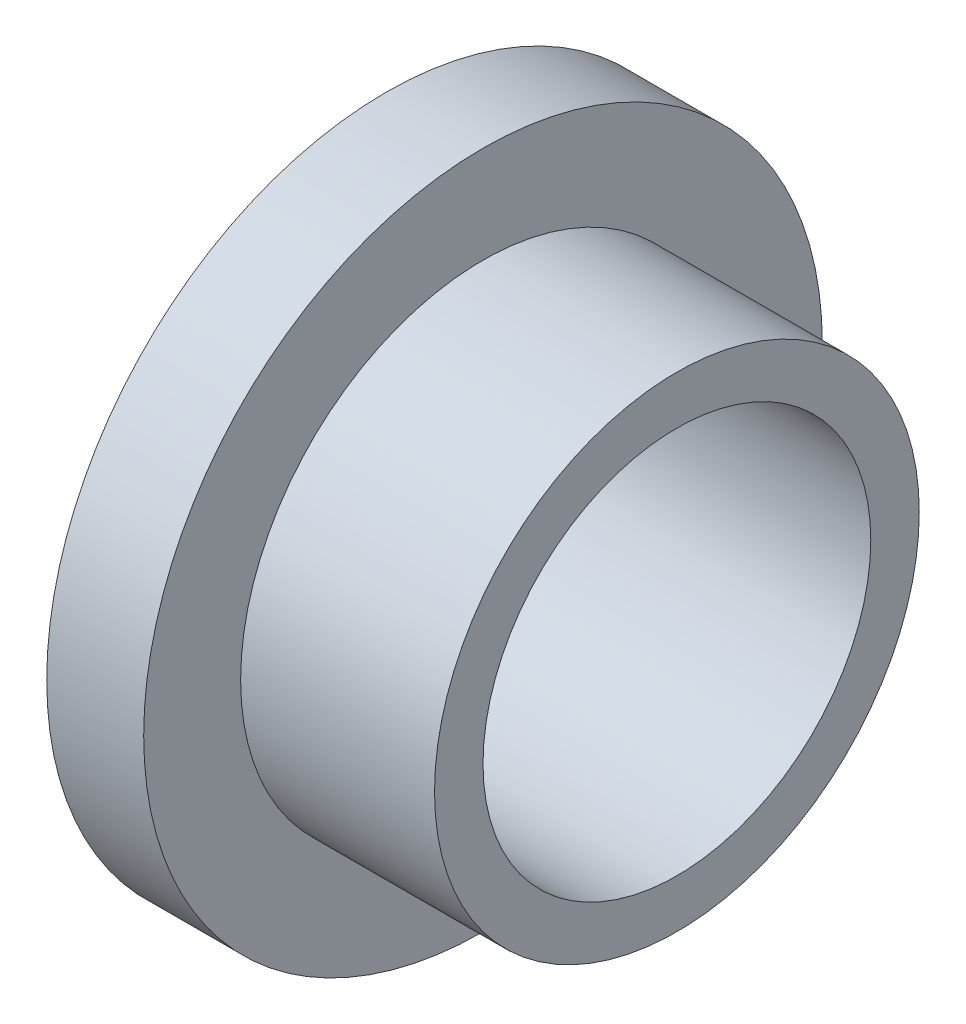
ISO-10303-21;
HEADER;
FILE_DESCRIPTION(('STEP AP214'),'2;1');
FILE_NAME('part.step','',(''),(''),'','','');
FILE_SCHEMA(('AUTOMOTIVE_DESIGN { 1 0 10303 214 1 1 1 1 }'));
ENDSEC;
DATA;
#1=APPLICATION_CONTEXT('core data for automotive mechanical design processes');
#2=APPLICATION_PROTOCOL_DEFINITION('international standard','automotive_design',2000,#1);
#3=PRODUCT_CONTEXT('',#1,'mechanical');
#4=PRODUCT('Part','Part','',(#3));
#5=PRODUCT_RELATED_PRODUCT_CATEGORY('part','',(#4));
#6=PRODUCT_DEFINITION_FORMATION('','',#4);
#7=PRODUCT_DEFINITION_CONTEXT('part definition',#1,'design');
#8=PRODUCT_DEFINITION('design','',#6,#7);
#9=PRODUCT_DEFINITION_SHAPE('','',#8);
#10=(LENGTH_UNIT() NAMED_UNIT(*) SI_UNIT(.MILLI.,.METRE.));
#11=(NAMED_UNIT(*) PLANE_ANGLE_UNIT() SI_UNIT($,.RADIAN.));
#12=(NAMED_UNIT(*) SI_UNIT($,.STERADIAN.) SOLID_ANGLE_UNIT());
#13=UNCERTAINTY_MEASURE_WITH_UNIT(LENGTH_MEASURE(1.E-05),#10,'distance_accuracy_value','');
#14=(GEOMETRIC_REPRESENTATION_CONTEXT(3) GLOBAL_UNCERTAINTY_ASSIGNED_CONTEXT((#13)) GLOBAL_UNIT_ASSIGNED_CONTEXT((#10,
#11,#12)) REPRESENTATION_CONTEXT('',''));
#15=CARTESIAN_POINT('',(0.,0.,0.));
#16=DIRECTION('',(0.,0.,1.));
#17=DIRECTION('',(1.,0.,0.));
#18=AXIS2_PLACEMENT_3D('',#15,#16,#17);
#19=CARTESIAN_POINT('',(9.525,0.,0.));
#20=DIRECTION('',(-1.,0.,0.));
#21=DIRECTION('',(0.,0.,1.));
#22=AXIS2_PLACEMENT_3D('',#19,#20,#21);
#23=CYLINDRICAL_SURFACE('',#22,7.9375);
#24=CARTESIAN_POINT('',(9.525,0.,0.));
#25=DIRECTION('',(1.,0.,0.));
#26=DIRECTION('',(0.,0.,-1.));
#27=AXIS2_PLACEMENT_3D('',#24,#25,#26);
#28=CIRCLE('',#27,7.9375);
#29=CARTESIAN_POINT('',(9.525,0.,-7.9375));
#30=VERTEX_POINT('',#29);
#31=EDGE_CURVE('E33',#30,#30,#28,.T.);
#32=ORIENTED_EDGE('',*,*,#31,.F.);
#33=EDGE_LOOP('',(#32));
#34=FACE_BOUND('',#33,.T.);
#35=CARTESIAN_POINT('',(3.175,0.,0.));
#36=DIRECTION('',(-1.,0.,0.));
#37=DIRECTION('',(0.,0.,1.));
#38=AXIS2_PLACEMENT_3D('',#35,#36,#37);
#39=CIRCLE('',#38,7.9375);
#40=CARTESIAN_POINT('',(3.175,0.,7.9375));
#41=VERTEX_POINT('',#40);
#42=EDGE_CURVE('E10',#41,#41,#39,.T.);
#43=ORIENTED_EDGE('',*,*,#42,.F.);
#44=EDGE_LOOP('',(#43));
#45=FACE_BOUND('',#44,.T.);
#46=ADVANCED_FACE('F30',(#34,#45),#23,.T.);
#47=CARTESIAN_POINT('',(9.525,0.,0.));
#48=DIRECTION('',(1.,0.,0.));
#49=DIRECTION('',(0.,0.,-1.));
#50=AXIS2_PLACEMENT_3D('',#47,#48,#49);
#51=PLANE('',#50);
#52=ORIENTED_EDGE('',*,*,#31,.T.);
#53=EDGE_LOOP('',(#52));
#54=FACE_BOUND('',#53,.T.);
#55=CARTESIAN_POINT('',(9.525,0.,0.));
#56=DIRECTION('',(1.,0.,0.));
#57=DIRECTION('',(0.,0.,-1.));
#58=AXIS2_PLACEMENT_3D('',#55,#56,#57);
#59=CIRCLE('',#58,6.35);
#60=CARTESIAN_POINT('',(9.525,0.,-6.35));
#61=VERTEX_POINT('',#60);
#62=EDGE_CURVE('E41',#61,#61,#59,.T.);
#63=ORIENTED_EDGE('',*,*,#62,.F.);
#64=EDGE_LOOP('',(#63));
#65=FACE_BOUND('',#64,.T.);
#66=ADVANCED_FACE('F72',(#54,#65),#51,.T.);
#67=CARTESIAN_POINT('',(0.,0.,0.));
#68=DIRECTION('',(1.,0.,0.));
#69=DIRECTION('',(0.,0.,-1.));
#70=AXIS2_PLACEMENT_3D('',#67,#68,#69);
#71=PLANE('',#70);
#72=CARTESIAN_POINT('',(0.,0.,0.));
#73=DIRECTION('',(1.,0.,0.));
#74=DIRECTION('',(0.,0.,-1.));
#75=AXIS2_PLACEMENT_3D('',#72,#73,#74);
#76=CIRCLE('',#75,6.35);
#77=CARTESIAN_POINT('',(0.,0.,-6.35));
#78=VERTEX_POINT('',#77);
#79=EDGE_CURVE('E47',#78,#78,#76,.T.);
#80=ORIENTED_EDGE('',*,*,#79,.T.);
#81=EDGE_LOOP('',(#80));
#82=FACE_BOUND('',#81,.T.);
#83=CARTESIAN_POINT('',(0.,0.,0.));
#84=DIRECTION('',(-1.,0.,0.));
#85=DIRECTION('',(0.,0.,1.));
#86=AXIS2_PLACEMENT_3D('',#83,#84,#85);
#87=CIRCLE('',#86,11.1125);
#88=CARTESIAN_POINT('',(0.,0.,11.1125));
#89=VERTEX_POINT('',#88);
#90=EDGE_CURVE('E44',#89,#89,#87,.T.);
#91=ORIENTED_EDGE('',*,*,#90,.T.);
#92=EDGE_LOOP('',(#91));
#93=FACE_BOUND('',#92,.T.);
#94=ADVANCED_FACE('F58',(#82,#93),#71,.F.);
#95=CARTESIAN_POINT('',(9.525,0.,0.));
#96=DIRECTION('',(-1.,0.,0.));
#97=DIRECTION('',(0.,0.,1.));
#98=AXIS2_PLACEMENT_3D('',#95,#96,#97);
#99=CYLINDRICAL_SURFACE('',#98,6.35);
#100=ORIENTED_EDGE('',*,*,#79,.F.);
#101=EDGE_LOOP('',(#100));
#102=FACE_BOUND('',#101,.T.);
#103=ORIENTED_EDGE('',*,*,#62,.T.);
#104=EDGE_LOOP('',(#103));
#105=FACE_BOUND('',#104,.T.);
#106=ADVANCED_FACE('F67',(#102,#105),#99,.F.);
#107=CARTESIAN_POINT('',(3.175,0.,0.));
#108=DIRECTION('',(-1.,0.,0.));
#109=DIRECTION('',(0.,0.,1.));
#110=AXIS2_PLACEMENT_3D('',#107,#108,#109);
#111=PLANE('',#110);
#112=CARTESIAN_POINT('',(3.175,0.,0.));
#113=DIRECTION('',(-1.,0.,0.));
#114=DIRECTION('',(0.,0.,1.));
#115=AXIS2_PLACEMENT_3D('',#112,#113,#114);
#116=CIRCLE('',#115,11.1125);
#117=CARTESIAN_POINT('',(3.175,0.,11.1125));
#118=VERTEX_POINT('',#117);
#119=EDGE_CURVE('E49',#118,#118,#116,.T.);
#120=ORIENTED_EDGE('',*,*,#119,.F.);
#121=EDGE_LOOP('',(#120));
#122=FACE_BOUND('',#121,.T.);
#123=ORIENTED_EDGE('',*,*,#42,.T.);
#124=EDGE_LOOP('',(#123));
#125=FACE_BOUND('',#124,.T.);
#126=ADVANCED_FACE('F62',(#122,#125),#111,.F.);
#127=CARTESIAN_POINT('',(3.175,0.,0.));
#128=DIRECTION('',(-1.,0.,0.));
#129=DIRECTION('',(0.,0.,1.));
#130=AXIS2_PLACEMENT_3D('',#127,#128,#129);
#131=CYLINDRICAL_SURFACE('',#130,11.1125);
#132=ORIENTED_EDGE('',*,*,#119,.T.);
#133=EDGE_LOOP('',(#132));
#134=FACE_BOUND('',#133,.T.);
#135=ORIENTED_EDGE('',*,*,#90,.F.);
#136=EDGE_LOOP('',(#135));
#137=FACE_BOUND('',#136,.T.);
#138=ADVANCED_FACE('F60',(#134,#137),#131,.T.);
#139=CLOSED_SHELL('',(#46,#66,#94,#106,#126,#138));
#140=MANIFOLD_SOLID_BREP('B2',#139);
#141=ADVANCED_BREP_SHAPE_REPRESENTATION('',(#18,#140),#14);
#142=SHAPE_DEFINITION_REPRESENTATION(#9,#141);
ENDSEC;
END-ISO-10303-21;
